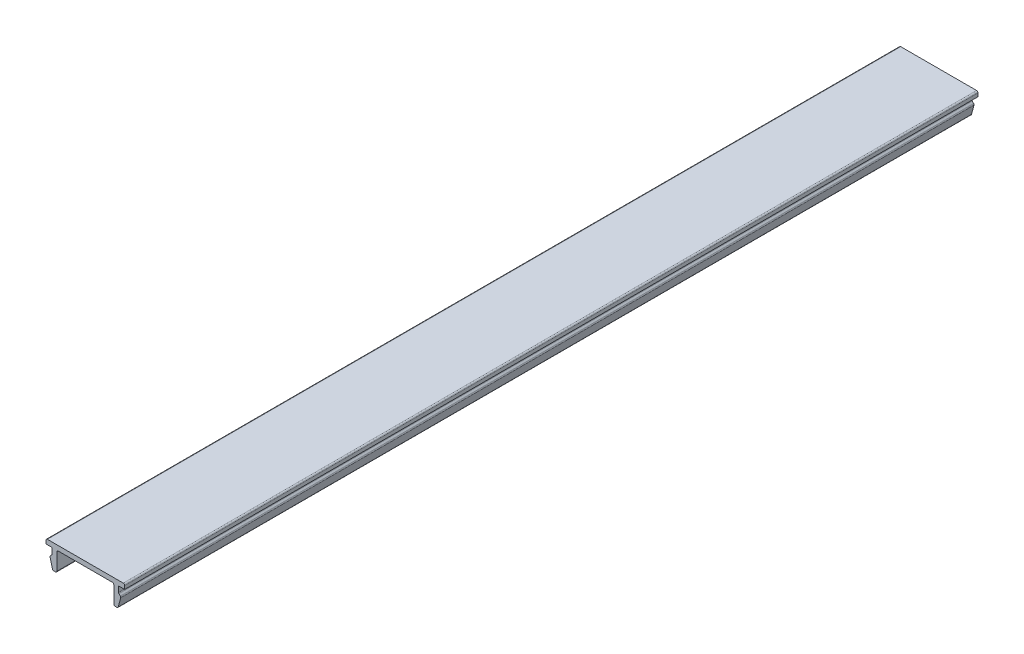
ISO-10303-21;
HEADER;
FILE_DESCRIPTION(('STEP AP214'),'2;1');
FILE_NAME('part.step','',(''),(''),'','','');
FILE_SCHEMA(('AUTOMOTIVE_DESIGN { 1 0 10303 214 1 1 1 1 }'));
ENDSEC;
DATA;
#1=APPLICATION_CONTEXT('core data for automotive mechanical design processes');
#2=APPLICATION_PROTOCOL_DEFINITION('international standard','automotive_design',2000,#1);
#3=PRODUCT_CONTEXT('',#1,'mechanical');
#4=PRODUCT('Part','Part','',(#3));
#5=PRODUCT_RELATED_PRODUCT_CATEGORY('part','',(#4));
#6=PRODUCT_DEFINITION_FORMATION('','',#4);
#7=PRODUCT_DEFINITION_CONTEXT('part definition',#1,'design');
#8=PRODUCT_DEFINITION('design','',#6,#7);
#9=PRODUCT_DEFINITION_SHAPE('','',#8);
#10=(LENGTH_UNIT() NAMED_UNIT(*) SI_UNIT(.MILLI.,.METRE.));
#11=(NAMED_UNIT(*) PLANE_ANGLE_UNIT() SI_UNIT($,.RADIAN.));
#12=(NAMED_UNIT(*) SI_UNIT($,.STERADIAN.) SOLID_ANGLE_UNIT());
#13=UNCERTAINTY_MEASURE_WITH_UNIT(LENGTH_MEASURE(1.E-05),#10,'distance_accuracy_value','');
#14=(GEOMETRIC_REPRESENTATION_CONTEXT(3) GLOBAL_UNCERTAINTY_ASSIGNED_CONTEXT((#13)) GLOBAL_UNIT_ASSIGNED_CONTEXT((#10,
#11,#12)) REPRESENTATION_CONTEXT('',''));
#15=CARTESIAN_POINT('',(0.,0.,0.));
#16=DIRECTION('',(0.,0.,1.));
#17=DIRECTION('',(1.,0.,0.));
#18=AXIS2_PLACEMENT_3D('',#15,#16,#17);
#19=CARTESIAN_POINT('',(-8.3,1.,180.));
#20=DIRECTION('',(1.,0.,0.));
#21=DIRECTION('',(0.,0.,-1.));
#22=AXIS2_PLACEMENT_3D('',#19,#20,#21);
#23=PLANE('',#22);
#24=DIRECTION('',(0.,-1.,0.));
#25=VECTOR('',#24,1.);
#26=CARTESIAN_POINT('',(-8.3,1.,180.));
#27=LINE('',#26,#25);
#28=CARTESIAN_POINT('',(-8.3,0.7,180.));
#29=VERTEX_POINT('',#28);
#30=CARTESIAN_POINT('',(-8.3,0.,180.));
#31=VERTEX_POINT('',#30);
#32=EDGE_CURVE('E224',#29,#31,#27,.T.);
#33=ORIENTED_EDGE('',*,*,#32,.F.);
#34=DIRECTION('',(0.,0.,-1.));
#35=VECTOR('',#34,1.);
#36=CARTESIAN_POINT('',(-8.3,0.7,180.));
#37=LINE('',#36,#35);
#38=CARTESIAN_POINT('',(-8.3,0.7,0.));
#39=VERTEX_POINT('',#38);
#40=EDGE_CURVE('E387',#29,#39,#37,.T.);
#41=ORIENTED_EDGE('',*,*,#40,.T.);
#42=DIRECTION('',(0.,-1.,0.));
#43=VECTOR('',#42,1.);
#44=CARTESIAN_POINT('',(-8.3,1.,0.));
#45=LINE('',#44,#43);
#46=CARTESIAN_POINT('',(-8.3,0.,0.));
#47=VERTEX_POINT('',#46);
#48=EDGE_CURVE('E252',#39,#47,#45,.T.);
#49=ORIENTED_EDGE('',*,*,#48,.T.);
#50=DIRECTION('',(0.,0.,-1.));
#51=VECTOR('',#50,1.);
#52=CARTESIAN_POINT('',(-8.3,0.,180.));
#53=LINE('',#52,#51);
#54=EDGE_CURVE('E244',#31,#47,#53,.T.);
#55=ORIENTED_EDGE('',*,*,#54,.F.);
#56=EDGE_LOOP('',(#33,#41,#49,#55));
#57=FACE_BOUND('',#56,.T.);
#58=ADVANCED_FACE('F39',(#57),#23,.F.);
#59=CARTESIAN_POINT('',(-8.3,0.,180.));
#60=DIRECTION('',(0.,1.,0.));
#61=DIRECTION('',(0.,0.,1.));
#62=AXIS2_PLACEMENT_3D('',#59,#60,#61);
#63=PLANE('',#62);
#64=DIRECTION('',(1.,0.,0.));
#65=VECTOR('',#64,1.);
#66=CARTESIAN_POINT('',(-8.3,0.,0.));
#67=LINE('',#66,#65);
#68=CARTESIAN_POINT('',(-7.,0.,0.));
#69=VERTEX_POINT('',#68);
#70=EDGE_CURVE('E422',#47,#69,#67,.T.);
#71=ORIENTED_EDGE('',*,*,#70,.T.);
#72=DIRECTION('',(0.,0.,-1.));
#73=VECTOR('',#72,1.);
#74=CARTESIAN_POINT('',(-7.,0.,180.));
#75=LINE('',#74,#73);
#76=CARTESIAN_POINT('',(-7.,0.,180.));
#77=VERTEX_POINT('',#76);
#78=EDGE_CURVE('E246',#77,#69,#75,.T.);
#79=ORIENTED_EDGE('',*,*,#78,.F.);
#80=DIRECTION('',(1.,0.,0.));
#81=VECTOR('',#80,1.);
#82=CARTESIAN_POINT('',(-8.3,0.,180.));
#83=LINE('',#82,#81);
#84=EDGE_CURVE('E229',#31,#77,#83,.T.);
#85=ORIENTED_EDGE('',*,*,#84,.F.);
#86=ORIENTED_EDGE('',*,*,#54,.T.);
#87=EDGE_LOOP('',(#71,#79,#85,#86));
#88=FACE_BOUND('',#87,.T.);
#89=ADVANCED_FACE('F243',(#88),#63,.F.);
#90=CARTESIAN_POINT('',(-7.,0.,180.));
#91=DIRECTION('',(1.,0.,0.));
#92=DIRECTION('',(0.,0.,-1.));
#93=AXIS2_PLACEMENT_3D('',#90,#91,#92);
#94=PLANE('',#93);
#95=DIRECTION('',(0.,-1.,0.));
#96=VECTOR('',#95,1.);
#97=CARTESIAN_POINT('',(-7.,0.,0.));
#98=LINE('',#97,#96);
#99=CARTESIAN_POINT('',(-7.,-1.17573593128807,0.));
#100=VERTEX_POINT('',#99);
#101=EDGE_CURVE('E413',#69,#100,#98,.T.);
#102=ORIENTED_EDGE('',*,*,#101,.T.);
#103=DIRECTION('',(0.,0.,-1.));
#104=VECTOR('',#103,1.);
#105=CARTESIAN_POINT('',(-7.,-1.17573593128807,180.));
#106=LINE('',#105,#104);
#107=CARTESIAN_POINT('',(-7.,-1.17573593128807,180.));
#108=VERTEX_POINT('',#107);
#109=EDGE_CURVE('E384',#100,#108,#106,.F.);
#110=ORIENTED_EDGE('',*,*,#109,.T.);
#111=DIRECTION('',(0.,-1.,0.));
#112=VECTOR('',#111,1.);
#113=CARTESIAN_POINT('',(-7.,0.,180.));
#114=LINE('',#113,#112);
#115=EDGE_CURVE('E249',#77,#108,#114,.T.);
#116=ORIENTED_EDGE('',*,*,#115,.F.);
#117=ORIENTED_EDGE('',*,*,#78,.T.);
#118=EDGE_LOOP('',(#102,#110,#116,#117));
#119=FACE_BOUND('',#118,.T.);
#120=ADVANCED_FACE('F420',(#119),#94,.F.);
#121=CARTESIAN_POINT('',(-7.,-1.3,180.));
#122=DIRECTION('',(0.707106781186547,-0.707106781186548,0.));
#123=DIRECTION('',(0.707106781186548,0.707106781186547,0.));
#124=AXIS2_PLACEMENT_3D('',#121,#122,#123);
#125=PLANE('',#124);
#126=DIRECTION('',(-0.707106781186548,-0.707106781186547,0.));
#127=VECTOR('',#126,1.);
#128=CARTESIAN_POINT('',(-7.,-1.3,0.));
#129=LINE('',#128,#127);
#130=CARTESIAN_POINT('',(-7.08786796564404,-1.38786796564404,0.));
#131=VERTEX_POINT('',#130);
#132=CARTESIAN_POINT('',(-7.37752551286084,-1.67752551286084,0.));
#133=VERTEX_POINT('',#132);
#134=EDGE_CURVE('E415',#131,#133,#129,.T.);
#135=ORIENTED_EDGE('',*,*,#134,.T.);
#136=DIRECTION('',(0.,0.,-1.));
#137=VECTOR('',#136,1.);
#138=CARTESIAN_POINT('',(-7.37752551286084,-1.67752551286084,180.));
#139=LINE('',#138,#137);
#140=CARTESIAN_POINT('',(-7.37752551286084,-1.67752551286084,180.));
#141=VERTEX_POINT('',#140);
#142=EDGE_CURVE('E381',#133,#141,#139,.F.);
#143=ORIENTED_EDGE('',*,*,#142,.T.);
#144=DIRECTION('',(-0.707106781186548,-0.707106781186547,0.));
#145=VECTOR('',#144,1.);
#146=CARTESIAN_POINT('',(-7.,-1.3,180.));
#147=LINE('',#146,#145);
#148=CARTESIAN_POINT('',(-7.08786796564404,-1.38786796564404,180.));
#149=VERTEX_POINT('',#148);
#150=EDGE_CURVE('E428',#149,#141,#147,.T.);
#151=ORIENTED_EDGE('',*,*,#150,.F.);
#152=DIRECTION('',(0.,0.,-1.));
#153=VECTOR('',#152,1.);
#154=CARTESIAN_POINT('',(-7.08786796564404,-1.38786796564404,0.));
#155=LINE('',#154,#153);
#156=EDGE_CURVE('E377',#149,#131,#155,.T.);
#157=ORIENTED_EDGE('',*,*,#156,.T.);
#158=EDGE_LOOP('',(#135,#143,#151,#157));
#159=FACE_BOUND('',#158,.T.);
#160=ADVANCED_FACE('F431',(#159),#125,.F.);
#161=CARTESIAN_POINT('',(-7.5,-1.8,180.));
#162=DIRECTION('',(0.965925826289068,0.258819045102522,0.));
#163=DIRECTION('',(-0.258819045102522,0.965925826289068,0.));
#164=AXIS2_PLACEMENT_3D('',#161,#162,#163);
#165=PLANE('',#164);
#166=DIRECTION('',(0.258819045102522,-0.965925826289068,0.));
#167=VECTOR('',#166,1.);
#168=CARTESIAN_POINT('',(-7.5,-1.8,0.));
#169=LINE('',#168,#167);
#170=CARTESIAN_POINT('',(-7.4551712263916,-1.96730326074756,0.));
#171=VERTEX_POINT('',#170);
#172=CARTESIAN_POINT('',(-6.94329650890145,-3.87764571353076,0.));
#173=VERTEX_POINT('',#172);
#174=EDGE_CURVE('E488',#171,#173,#169,.T.);
#175=ORIENTED_EDGE('',*,*,#174,.T.);
#176=DIRECTION('',(0.,0.,-1.));
#177=VECTOR('',#176,1.);
#178=CARTESIAN_POINT('',(-6.94329650890145,-3.87764571353076,180.));
#179=LINE('',#178,#177);
#180=CARTESIAN_POINT('',(-6.94329650890145,-3.87764571353076,180.));
#181=VERTEX_POINT('',#180);
#182=EDGE_CURVE('E374',#173,#181,#179,.F.);
#183=ORIENTED_EDGE('',*,*,#182,.T.);
#184=DIRECTION('',(0.258819045102522,-0.965925826289068,0.));
#185=VECTOR('',#184,1.);
#186=CARTESIAN_POINT('',(-7.5,-1.8,180.));
#187=LINE('',#186,#185);
#188=CARTESIAN_POINT('',(-7.4551712263916,-1.96730326074756,180.));
#189=VERTEX_POINT('',#188);
#190=EDGE_CURVE('E434',#189,#181,#187,.T.);
#191=ORIENTED_EDGE('',*,*,#190,.F.);
#192=DIRECTION('',(0.,0.,-1.));
#193=VECTOR('',#192,1.);
#194=CARTESIAN_POINT('',(-7.4551712263916,-1.96730326074756,180.));
#195=LINE('',#194,#193);
#196=EDGE_CURVE('E370',#189,#171,#195,.T.);
#197=ORIENTED_EDGE('',*,*,#196,.T.);
#198=EDGE_LOOP('',(#175,#183,#191,#197));
#199=FACE_BOUND('',#198,.T.);
#200=ADVANCED_FACE('F613',(#199),#165,.F.);
#201=CARTESIAN_POINT('',(-6.,-4.1,180.));
#202=DIRECTION('',(0.,1.,0.));
#203=DIRECTION('',(0.,0.,1.));
#204=AXIS2_PLACEMENT_3D('',#201,#202,#203);
#205=PLANE('',#204);
#206=DIRECTION('',(1.,0.,0.));
#207=VECTOR('',#206,1.);
#208=CARTESIAN_POINT('',(-6.,-4.1,0.));
#209=LINE('',#208,#207);
#210=CARTESIAN_POINT('',(-6.65351876101473,-4.1,0.));
#211=VERTEX_POINT('',#210);
#212=CARTESIAN_POINT('',(-6.3,-4.1,0.));
#213=VERTEX_POINT('',#212);
#214=EDGE_CURVE('E492',#211,#213,#209,.T.);
#215=ORIENTED_EDGE('',*,*,#214,.T.);
#216=DIRECTION('',(0.,0.,-1.));
#217=VECTOR('',#216,1.);
#218=CARTESIAN_POINT('',(-6.3,-4.1,180.));
#219=LINE('',#218,#217);
#220=CARTESIAN_POINT('',(-6.3,-4.1,180.));
#221=VERTEX_POINT('',#220);
#222=EDGE_CURVE('E367',#213,#221,#219,.F.);
#223=ORIENTED_EDGE('',*,*,#222,.T.);
#224=DIRECTION('',(1.,0.,0.));
#225=VECTOR('',#224,1.);
#226=CARTESIAN_POINT('',(-6.,-4.1,180.));
#227=LINE('',#226,#225);
#228=CARTESIAN_POINT('',(-6.65351876101473,-4.1,180.));
#229=VERTEX_POINT('',#228);
#230=EDGE_CURVE('E439',#229,#221,#227,.T.);
#231=ORIENTED_EDGE('',*,*,#230,.F.);
#232=DIRECTION('',(0.,0.,-1.));
#233=VECTOR('',#232,1.);
#234=CARTESIAN_POINT('',(-6.65351876101473,-4.1,180.));
#235=LINE('',#234,#233);
#236=EDGE_CURVE('E363',#229,#211,#235,.T.);
#237=ORIENTED_EDGE('',*,*,#236,.T.);
#238=EDGE_LOOP('',(#215,#223,#231,#237));
#239=FACE_BOUND('',#238,.T.);
#240=ADVANCED_FACE('F620',(#239),#205,.F.);
#241=CARTESIAN_POINT('',(-6.,0.,180.));
#242=DIRECTION('',(-1.,0.,0.));
#243=DIRECTION('',(0.,-1.,0.));
#244=AXIS2_PLACEMENT_3D('',#241,#242,#243);
#245=PLANE('',#244);
#246=DIRECTION('',(0.,1.,0.));
#247=VECTOR('',#246,1.);
#248=CARTESIAN_POINT('',(-6.,0.,0.));
#249=LINE('',#248,#247);
#250=CARTESIAN_POINT('',(-6.,-3.8,0.));
#251=VERTEX_POINT('',#250);
#252=CARTESIAN_POINT('',(-6.,-0.3,0.));
#253=VERTEX_POINT('',#252);
#254=EDGE_CURVE('E496',#251,#253,#249,.T.);
#255=ORIENTED_EDGE('',*,*,#254,.T.);
#256=DIRECTION('',(0.,0.,-1.));
#257=VECTOR('',#256,1.);
#258=CARTESIAN_POINT('',(-6.,-0.3,180.));
#259=LINE('',#258,#257);
#260=CARTESIAN_POINT('',(-6.,-0.3,180.));
#261=VERTEX_POINT('',#260);
#262=EDGE_CURVE('E360',#253,#261,#259,.F.);
#263=ORIENTED_EDGE('',*,*,#262,.T.);
#264=DIRECTION('',(0.,1.,0.));
#265=VECTOR('',#264,1.);
#266=CARTESIAN_POINT('',(-6.,0.,180.));
#267=LINE('',#266,#265);
#268=CARTESIAN_POINT('',(-6.,-3.8,180.));
#269=VERTEX_POINT('',#268);
#270=EDGE_CURVE('E446',#269,#261,#267,.T.);
#271=ORIENTED_EDGE('',*,*,#270,.F.);
#272=DIRECTION('',(0.,0.,-1.));
#273=VECTOR('',#272,1.);
#274=CARTESIAN_POINT('',(-6.,-3.8,180.));
#275=LINE('',#274,#273);
#276=EDGE_CURVE('E356',#269,#251,#275,.T.);
#277=ORIENTED_EDGE('',*,*,#276,.T.);
#278=EDGE_LOOP('',(#255,#263,#271,#277));
#279=FACE_BOUND('',#278,.T.);
#280=ADVANCED_FACE('F627',(#279),#245,.F.);
#281=CARTESIAN_POINT('',(-6.,0.,180.));
#282=DIRECTION('',(0.,1.,0.));
#283=DIRECTION('',(0.,0.,1.));
#284=AXIS2_PLACEMENT_3D('',#281,#282,#283);
#285=PLANE('',#284);
#286=DIRECTION('',(1.,0.,0.));
#287=VECTOR('',#286,1.);
#288=CARTESIAN_POINT('',(-6.,0.,0.));
#289=LINE('',#288,#287);
#290=CARTESIAN_POINT('',(-5.7,0.,0.));
#291=VERTEX_POINT('',#290);
#292=CARTESIAN_POINT('',(5.69999999999999,0.,0.));
#293=VERTEX_POINT('',#292);
#294=EDGE_CURVE('E500',#291,#293,#289,.T.);
#295=ORIENTED_EDGE('',*,*,#294,.T.);
#296=DIRECTION('',(0.,0.,-1.));
#297=VECTOR('',#296,1.);
#298=CARTESIAN_POINT('',(5.69999999999999,0.,180.));
#299=LINE('',#298,#297);
#300=CARTESIAN_POINT('',(5.69999999999999,0.,180.));
#301=VERTEX_POINT('',#300);
#302=EDGE_CURVE('E353',#293,#301,#299,.F.);
#303=ORIENTED_EDGE('',*,*,#302,.T.);
#304=DIRECTION('',(1.,0.,0.));
#305=VECTOR('',#304,1.);
#306=CARTESIAN_POINT('',(-6.,0.,180.));
#307=LINE('',#306,#305);
#308=CARTESIAN_POINT('',(-5.7,0.,180.));
#309=VERTEX_POINT('',#308);
#310=EDGE_CURVE('E450',#309,#301,#307,.T.);
#311=ORIENTED_EDGE('',*,*,#310,.F.);
#312=DIRECTION('',(0.,0.,-1.));
#313=VECTOR('',#312,1.);
#314=CARTESIAN_POINT('',(-5.7,0.,0.));
#315=LINE('',#314,#313);
#316=EDGE_CURVE('E349',#309,#291,#315,.T.);
#317=ORIENTED_EDGE('',*,*,#316,.T.);
#318=EDGE_LOOP('',(#295,#303,#311,#317));
#319=FACE_BOUND('',#318,.T.);
#320=ADVANCED_FACE('F634',(#319),#285,.F.);
#321=CARTESIAN_POINT('',(5.99999999999999,0.,180.));
#322=DIRECTION('',(1.,0.,0.));
#323=DIRECTION('',(0.,1.,0.));
#324=AXIS2_PLACEMENT_3D('',#321,#322,#323);
#325=PLANE('',#324);
#326=DIRECTION('',(0.,-1.,0.));
#327=VECTOR('',#326,1.);
#328=CARTESIAN_POINT('',(5.99999999999999,0.,0.));
#329=LINE('',#328,#327);
#330=CARTESIAN_POINT('',(5.99999999999999,-0.3,0.));
#331=VERTEX_POINT('',#330);
#332=CARTESIAN_POINT('',(5.99999999999999,-3.8,0.));
#333=VERTEX_POINT('',#332);
#334=EDGE_CURVE('E504',#331,#333,#329,.T.);
#335=ORIENTED_EDGE('',*,*,#334,.T.);
#336=DIRECTION('',(0.,0.,-1.));
#337=VECTOR('',#336,1.);
#338=CARTESIAN_POINT('',(5.99999999999999,-3.8,180.));
#339=LINE('',#338,#337);
#340=CARTESIAN_POINT('',(5.99999999999999,-3.8,180.));
#341=VERTEX_POINT('',#340);
#342=EDGE_CURVE('E346',#333,#341,#339,.F.);
#343=ORIENTED_EDGE('',*,*,#342,.T.);
#344=DIRECTION('',(0.,-1.,0.));
#345=VECTOR('',#344,1.);
#346=CARTESIAN_POINT('',(5.99999999999999,0.,180.));
#347=LINE('',#346,#345);
#348=CARTESIAN_POINT('',(5.99999999999999,-0.3,180.));
#349=VERTEX_POINT('',#348);
#350=EDGE_CURVE('E454',#349,#341,#347,.T.);
#351=ORIENTED_EDGE('',*,*,#350,.F.);
#352=DIRECTION('',(0.,0.,-1.));
#353=VECTOR('',#352,1.);
#354=CARTESIAN_POINT('',(5.99999999999999,-0.3,0.));
#355=LINE('',#354,#353);
#356=EDGE_CURVE('E342',#349,#331,#355,.T.);
#357=ORIENTED_EDGE('',*,*,#356,.T.);
#358=EDGE_LOOP('',(#335,#343,#351,#357));
#359=FACE_BOUND('',#358,.T.);
#360=ADVANCED_FACE('F641',(#359),#325,.F.);
#361=CARTESIAN_POINT('',(5.99999999999999,-4.1,180.));
#362=DIRECTION('',(0.,1.,0.));
#363=DIRECTION('',(0.,0.,1.));
#364=AXIS2_PLACEMENT_3D('',#361,#362,#363);
#365=PLANE('',#364);
#366=DIRECTION('',(1.,0.,0.));
#367=VECTOR('',#366,1.);
#368=CARTESIAN_POINT('',(5.99999999999999,-4.1,0.));
#369=LINE('',#368,#367);
#370=CARTESIAN_POINT('',(6.29999999999999,-4.1,0.));
#371=VERTEX_POINT('',#370);
#372=CARTESIAN_POINT('',(6.65351876101472,-4.1,0.));
#373=VERTEX_POINT('',#372);
#374=EDGE_CURVE('E508',#371,#373,#369,.T.);
#375=ORIENTED_EDGE('',*,*,#374,.T.);
#376=DIRECTION('',(0.,0.,-1.));
#377=VECTOR('',#376,1.);
#378=CARTESIAN_POINT('',(6.65351876101472,-4.1,180.));
#379=LINE('',#378,#377);
#380=CARTESIAN_POINT('',(6.65351876101472,-4.1,180.));
#381=VERTEX_POINT('',#380);
#382=EDGE_CURVE('E339',#373,#381,#379,.F.);
#383=ORIENTED_EDGE('',*,*,#382,.T.);
#384=DIRECTION('',(1.,0.,0.));
#385=VECTOR('',#384,1.);
#386=CARTESIAN_POINT('',(5.99999999999999,-4.1,180.));
#387=LINE('',#386,#385);
#388=CARTESIAN_POINT('',(6.29999999999999,-4.1,180.));
#389=VERTEX_POINT('',#388);
#390=EDGE_CURVE('E458',#389,#381,#387,.T.);
#391=ORIENTED_EDGE('',*,*,#390,.F.);
#392=DIRECTION('',(0.,0.,-1.));
#393=VECTOR('',#392,1.);
#394=CARTESIAN_POINT('',(6.29999999999999,-4.1,180.));
#395=LINE('',#394,#393);
#396=EDGE_CURVE('E335',#389,#371,#395,.T.);
#397=ORIENTED_EDGE('',*,*,#396,.T.);
#398=EDGE_LOOP('',(#375,#383,#391,#397));
#399=FACE_BOUND('',#398,.T.);
#400=ADVANCED_FACE('F648',(#399),#365,.F.);
#401=CARTESIAN_POINT('',(7.49999999999999,-1.8,180.));
#402=DIRECTION('',(-0.965925826289068,0.258819045102522,0.));
#403=DIRECTION('',(-0.258819045102522,-0.965925826289068,0.));
#404=AXIS2_PLACEMENT_3D('',#401,#402,#403);
#405=PLANE('',#404);
#406=DIRECTION('',(0.258819045102522,0.965925826289068,0.));
#407=VECTOR('',#406,1.);
#408=CARTESIAN_POINT('',(7.49999999999999,-1.8,0.));
#409=LINE('',#408,#407);
#410=CARTESIAN_POINT('',(6.94329650890144,-3.87764571353075,0.));
#411=VERTEX_POINT('',#410);
#412=CARTESIAN_POINT('',(7.45517122639159,-1.96730326074756,0.));
#413=VERTEX_POINT('',#412);
#414=EDGE_CURVE('E512',#411,#413,#409,.T.);
#415=ORIENTED_EDGE('',*,*,#414,.T.);
#416=DIRECTION('',(0.,0.,-1.));
#417=VECTOR('',#416,1.);
#418=CARTESIAN_POINT('',(7.45517122639159,-1.96730326074756,180.));
#419=LINE('',#418,#417);
#420=CARTESIAN_POINT('',(7.45517122639159,-1.96730326074756,180.));
#421=VERTEX_POINT('',#420);
#422=EDGE_CURVE('E332',#413,#421,#419,.F.);
#423=ORIENTED_EDGE('',*,*,#422,.T.);
#424=DIRECTION('',(0.258819045102522,0.965925826289068,0.));
#425=VECTOR('',#424,1.);
#426=CARTESIAN_POINT('',(7.49999999999999,-1.8,180.));
#427=LINE('',#426,#425);
#428=CARTESIAN_POINT('',(6.94329650890144,-3.87764571353075,180.));
#429=VERTEX_POINT('',#428);
#430=EDGE_CURVE('E462',#429,#421,#427,.T.);
#431=ORIENTED_EDGE('',*,*,#430,.F.);
#432=DIRECTION('',(0.,0.,-1.));
#433=VECTOR('',#432,1.);
#434=CARTESIAN_POINT('',(6.94329650890144,-3.87764571353075,180.));
#435=LINE('',#434,#433);
#436=EDGE_CURVE('E328',#429,#411,#435,.T.);
#437=ORIENTED_EDGE('',*,*,#436,.T.);
#438=EDGE_LOOP('',(#415,#423,#431,#437));
#439=FACE_BOUND('',#438,.T.);
#440=ADVANCED_FACE('F655',(#439),#405,.F.);
#441=CARTESIAN_POINT('',(6.99999999999999,-1.3,180.));
#442=DIRECTION('',(-0.707106781186547,-0.707106781186548,0.));
#443=DIRECTION('',(0.707106781186548,-0.707106781186547,0.));
#444=AXIS2_PLACEMENT_3D('',#441,#442,#443);
#445=PLANE('',#444);
#446=DIRECTION('',(-0.707106781186548,0.707106781186547,0.));
#447=VECTOR('',#446,1.);
#448=CARTESIAN_POINT('',(6.99999999999999,-1.3,0.));
#449=LINE('',#448,#447);
#450=CARTESIAN_POINT('',(7.37752551286083,-1.67752551286084,0.));
#451=VERTEX_POINT('',#450);
#452=CARTESIAN_POINT('',(7.08786796564403,-1.38786796564403,0.));
#453=VERTEX_POINT('',#452);
#454=EDGE_CURVE('E516',#451,#453,#449,.T.);
#455=ORIENTED_EDGE('',*,*,#454,.T.);
#456=DIRECTION('',(0.,0.,-1.));
#457=VECTOR('',#456,1.);
#458=CARTESIAN_POINT('',(7.08786796564403,-1.38786796564403,180.));
#459=LINE('',#458,#457);
#460=CARTESIAN_POINT('',(7.08786796564403,-1.38786796564403,180.));
#461=VERTEX_POINT('',#460);
#462=EDGE_CURVE('E63',#453,#461,#459,.F.);
#463=ORIENTED_EDGE('',*,*,#462,.T.);
#464=DIRECTION('',(-0.707106781186548,0.707106781186547,0.));
#465=VECTOR('',#464,1.);
#466=CARTESIAN_POINT('',(6.99999999999999,-1.3,180.));
#467=LINE('',#466,#465);
#468=CARTESIAN_POINT('',(7.37752551286083,-1.67752551286084,180.));
#469=VERTEX_POINT('',#468);
#470=EDGE_CURVE('E466',#469,#461,#467,.T.);
#471=ORIENTED_EDGE('',*,*,#470,.F.);
#472=DIRECTION('',(0.,0.,-1.));
#473=VECTOR('',#472,1.);
#474=CARTESIAN_POINT('',(7.37752551286083,-1.67752551286084,180.));
#475=LINE('',#474,#473);
#476=EDGE_CURVE('E322',#469,#451,#475,.T.);
#477=ORIENTED_EDGE('',*,*,#476,.T.);
#478=EDGE_LOOP('',(#455,#463,#471,#477));
#479=FACE_BOUND('',#478,.T.);
#480=ADVANCED_FACE('F659',(#479),#445,.F.);
#481=CARTESIAN_POINT('',(6.99999999999999,0.,180.));
#482=DIRECTION('',(-1.,0.,0.));
#483=DIRECTION('',(0.,0.,1.));
#484=AXIS2_PLACEMENT_3D('',#481,#482,#483);
#485=PLANE('',#484);
#486=DIRECTION('',(0.,1.,0.));
#487=VECTOR('',#486,1.);
#488=CARTESIAN_POINT('',(6.99999999999999,0.,180.));
#489=LINE('',#488,#487);
#490=CARTESIAN_POINT('',(6.99999999999999,-1.17573593128807,180.));
#491=VERTEX_POINT('',#490);
#492=CARTESIAN_POINT('',(6.99999999999999,0.,180.));
#493=VERTEX_POINT('',#492);
#494=EDGE_CURVE('E469',#491,#493,#489,.T.);
#495=ORIENTED_EDGE('',*,*,#494,.F.);
#496=DIRECTION('',(0.,0.,-1.));
#497=VECTOR('',#496,1.);
#498=CARTESIAN_POINT('',(6.99999999999999,-1.17573593128807,0.));
#499=LINE('',#498,#497);
#500=CARTESIAN_POINT('',(6.99999999999999,-1.17573593128807,0.));
#501=VERTEX_POINT('',#500);
#502=EDGE_CURVE('E318',#491,#501,#499,.T.);
#503=ORIENTED_EDGE('',*,*,#502,.T.);
#504=DIRECTION('',(0.,1.,0.));
#505=VECTOR('',#504,1.);
#506=CARTESIAN_POINT('',(6.99999999999999,0.,0.));
#507=LINE('',#506,#505);
#508=CARTESIAN_POINT('',(6.99999999999999,0.,0.));
#509=VERTEX_POINT('',#508);
#510=EDGE_CURVE('E519',#501,#509,#507,.T.);
#511=ORIENTED_EDGE('',*,*,#510,.T.);
#512=DIRECTION('',(0.,0.,-1.));
#513=VECTOR('',#512,1.);
#514=CARTESIAN_POINT('',(6.99999999999999,0.,180.));
#515=LINE('',#514,#513);
#516=EDGE_CURVE('E261',#493,#509,#515,.T.);
#517=ORIENTED_EDGE('',*,*,#516,.F.);
#518=EDGE_LOOP('',(#495,#503,#511,#517));
#519=FACE_BOUND('',#518,.T.);
#520=ADVANCED_FACE('F662',(#519),#485,.F.);
#521=CARTESIAN_POINT('',(6.99999999999999,0.,180.));
#522=DIRECTION('',(0.,1.,0.));
#523=DIRECTION('',(0.,0.,1.));
#524=AXIS2_PLACEMENT_3D('',#521,#522,#523);
#525=PLANE('',#524);
#526=DIRECTION('',(1.,0.,0.));
#527=VECTOR('',#526,1.);
#528=CARTESIAN_POINT('',(6.99999999999999,0.,0.));
#529=LINE('',#528,#527);
#530=CARTESIAN_POINT('',(8.3,0.,0.));
#531=VERTEX_POINT('',#530);
#532=EDGE_CURVE('E522',#509,#531,#529,.T.);
#533=ORIENTED_EDGE('',*,*,#532,.T.);
#534=DIRECTION('',(0.,0.,-1.));
#535=VECTOR('',#534,1.);
#536=CARTESIAN_POINT('',(8.3,0.,180.));
#537=LINE('',#536,#535);
#538=CARTESIAN_POINT('',(8.3,0.,180.));
#539=VERTEX_POINT('',#538);
#540=EDGE_CURVE('E481',#539,#531,#537,.T.);
#541=ORIENTED_EDGE('',*,*,#540,.F.);
#542=DIRECTION('',(1.,0.,0.));
#543=VECTOR('',#542,1.);
#544=CARTESIAN_POINT('',(6.99999999999999,0.,180.));
#545=LINE('',#544,#543);
#546=EDGE_CURVE('E472',#493,#539,#545,.T.);
#547=ORIENTED_EDGE('',*,*,#546,.F.);
#548=ORIENTED_EDGE('',*,*,#516,.T.);
#549=EDGE_LOOP('',(#533,#541,#547,#548));
#550=FACE_BOUND('',#549,.T.);
#551=ADVANCED_FACE('F540',(#550),#525,.F.);
#552=CARTESIAN_POINT('',(8.3,1.,180.));
#553=DIRECTION('',(-1.,0.,0.));
#554=DIRECTION('',(0.,0.,1.));
#555=AXIS2_PLACEMENT_3D('',#552,#553,#554);
#556=PLANE('',#555);
#557=DIRECTION('',(0.,1.,0.));
#558=VECTOR('',#557,1.);
#559=CARTESIAN_POINT('',(8.3,1.,0.));
#560=LINE('',#559,#558);
#561=CARTESIAN_POINT('',(8.3,0.700000000000004,0.));
#562=VERTEX_POINT('',#561);
#563=EDGE_CURVE('E525',#531,#562,#560,.T.);
#564=ORIENTED_EDGE('',*,*,#563,.T.);
#565=DIRECTION('',(0.,0.,-1.));
#566=VECTOR('',#565,1.);
#567=CARTESIAN_POINT('',(8.3,0.700000000000004,180.));
#568=LINE('',#567,#566);
#569=CARTESIAN_POINT('',(8.3,0.700000000000004,180.));
#570=VERTEX_POINT('',#569);
#571=EDGE_CURVE('E292',#562,#570,#568,.F.);
#572=ORIENTED_EDGE('',*,*,#571,.T.);
#573=DIRECTION('',(0.,1.,0.));
#574=VECTOR('',#573,1.);
#575=CARTESIAN_POINT('',(8.3,1.,180.));
#576=LINE('',#575,#574);
#577=EDGE_CURVE('E475',#539,#570,#576,.T.);
#578=ORIENTED_EDGE('',*,*,#577,.F.);
#579=ORIENTED_EDGE('',*,*,#540,.T.);
#580=EDGE_LOOP('',(#564,#572,#578,#579));
#581=FACE_BOUND('',#580,.T.);
#582=ADVANCED_FACE('F547',(#581),#556,.F.);
#583=CARTESIAN_POINT('',(-8.3,1.,180.));
#584=DIRECTION('',(0.,-1.,0.));
#585=DIRECTION('',(1.,0.,0.));
#586=AXIS2_PLACEMENT_3D('',#583,#584,#585);
#587=PLANE('',#586);
#588=DIRECTION('',(-1.,0.,0.));
#589=VECTOR('',#588,1.);
#590=CARTESIAN_POINT('',(-8.3,1.,180.));
#591=LINE('',#590,#589);
#592=CARTESIAN_POINT('',(7.99999999999999,1.,180.));
#593=VERTEX_POINT('',#592);
#594=CARTESIAN_POINT('',(-8.,1.,180.));
#595=VERTEX_POINT('',#594);
#596=EDGE_CURVE('E478',#593,#595,#591,.T.);
#597=ORIENTED_EDGE('',*,*,#596,.F.);
#598=DIRECTION('',(0.,0.,-1.));
#599=VECTOR('',#598,1.);
#600=CARTESIAN_POINT('',(8.,1.,180.));
#601=LINE('',#600,#599);
#602=CARTESIAN_POINT('',(7.99999999999999,1.,0.));
#603=VERTEX_POINT('',#602);
#604=EDGE_CURVE('E259',#593,#603,#601,.T.);
#605=ORIENTED_EDGE('',*,*,#604,.T.);
#606=DIRECTION('',(-1.,0.,0.));
#607=VECTOR('',#606,1.);
#608=CARTESIAN_POINT('',(-8.3,1.,0.));
#609=LINE('',#608,#607);
#610=CARTESIAN_POINT('',(-8.,1.,0.));
#611=VERTEX_POINT('',#610);
#612=EDGE_CURVE('E239',#603,#611,#609,.T.);
#613=ORIENTED_EDGE('',*,*,#612,.T.);
#614=DIRECTION('',(0.,0.,-1.));
#615=VECTOR('',#614,1.);
#616=CARTESIAN_POINT('',(-8.,1.,180.));
#617=LINE('',#616,#615);
#618=EDGE_CURVE('E255',#611,#595,#617,.F.);
#619=ORIENTED_EDGE('',*,*,#618,.T.);
#620=EDGE_LOOP('',(#597,#605,#613,#619));
#621=FACE_BOUND('',#620,.T.);
#622=ADVANCED_FACE('F555',(#621),#587,.F.);
#623=CARTESIAN_POINT('',(0.,0.,180.));
#624=DIRECTION('',(0.,0.,1.));
#625=DIRECTION('',(1.,0.,0.));
#626=AXIS2_PLACEMENT_3D('',#623,#624,#625);
#627=PLANE('',#626);
#628=ORIENTED_EDGE('',*,*,#577,.T.);
#629=CARTESIAN_POINT('',(8.,0.700000000000004,180.));
#630=DIRECTION('',(0.,0.,1.));
#631=DIRECTION('',(1.,0.,0.));
#632=AXIS2_PLACEMENT_3D('',#629,#630,#631);
#633=CIRCLE('',#632,0.3);
#634=EDGE_CURVE('E315',#570,#593,#633,.T.);
#635=ORIENTED_EDGE('',*,*,#634,.T.);
#636=ORIENTED_EDGE('',*,*,#596,.T.);
#637=CARTESIAN_POINT('',(-8.,0.7,180.));
#638=DIRECTION('',(0.,0.,1.));
#639=DIRECTION('',(1.,0.,0.));
#640=AXIS2_PLACEMENT_3D('',#637,#638,#639);
#641=CIRCLE('',#640,0.3);
#642=EDGE_CURVE('E233',#595,#29,#641,.T.);
#643=ORIENTED_EDGE('',*,*,#642,.T.);
#644=ORIENTED_EDGE('',*,*,#32,.T.);
#645=ORIENTED_EDGE('',*,*,#84,.T.);
#646=ORIENTED_EDGE('',*,*,#115,.T.);
#647=CARTESIAN_POINT('',(-7.3,-1.17573593128807,180.));
#648=DIRECTION('',(0.,0.,1.));
#649=DIRECTION('',(1.,0.,0.));
#650=AXIS2_PLACEMENT_3D('',#647,#648,#649);
#651=CIRCLE('',#650,0.3);
#652=EDGE_CURVE('E11',#108,#149,#651,.F.);
#653=ORIENTED_EDGE('',*,*,#652,.T.);
#654=ORIENTED_EDGE('',*,*,#150,.T.);
#655=CARTESIAN_POINT('',(-7.16539347850488,-1.8896575472168,180.));
#656=DIRECTION('',(0.,0.,1.));
#657=DIRECTION('',(1.,0.,0.));
#658=AXIS2_PLACEMENT_3D('',#655,#656,#657);
#659=CIRCLE('',#658,0.3);
#660=EDGE_CURVE('E297',#141,#189,#659,.T.);
#661=ORIENTED_EDGE('',*,*,#660,.T.);
#662=ORIENTED_EDGE('',*,*,#190,.T.);
#663=CARTESIAN_POINT('',(-6.65351876101473,-3.8,180.));
#664=DIRECTION('',(0.,0.,1.));
#665=DIRECTION('',(1.,0.,0.));
#666=AXIS2_PLACEMENT_3D('',#663,#664,#665);
#667=CIRCLE('',#666,0.3);
#668=EDGE_CURVE('E300',#181,#229,#667,.T.);
#669=ORIENTED_EDGE('',*,*,#668,.T.);
#670=ORIENTED_EDGE('',*,*,#230,.T.);
#671=CARTESIAN_POINT('',(-6.3,-3.8,180.));
#672=DIRECTION('',(0.,0.,1.));
#673=DIRECTION('',(1.,0.,0.));
#674=AXIS2_PLACEMENT_3D('',#671,#672,#673);
#675=CIRCLE('',#674,0.3);
#676=EDGE_CURVE('E303',#221,#269,#675,.T.);
#677=ORIENTED_EDGE('',*,*,#676,.T.);
#678=ORIENTED_EDGE('',*,*,#270,.T.);
#679=CARTESIAN_POINT('',(-5.7,-0.3,180.));
#680=DIRECTION('',(0.,0.,1.));
#681=DIRECTION('',(1.,0.,0.));
#682=AXIS2_PLACEMENT_3D('',#679,#680,#681);
#683=CIRCLE('',#682,0.3);
#684=EDGE_CURVE('E404',#261,#309,#683,.F.);
#685=ORIENTED_EDGE('',*,*,#684,.T.);
#686=ORIENTED_EDGE('',*,*,#310,.T.);
#687=CARTESIAN_POINT('',(5.69999999999999,-0.3,180.));
#688=DIRECTION('',(0.,0.,1.));
#689=DIRECTION('',(1.,0.,0.));
#690=AXIS2_PLACEMENT_3D('',#687,#688,#689);
#691=CIRCLE('',#690,0.3);
#692=EDGE_CURVE('E398',#301,#349,#691,.F.);
#693=ORIENTED_EDGE('',*,*,#692,.T.);
#694=ORIENTED_EDGE('',*,*,#350,.T.);
#695=CARTESIAN_POINT('',(6.29999999999999,-3.8,180.));
#696=DIRECTION('',(0.,0.,1.));
#697=DIRECTION('',(1.,0.,0.));
#698=AXIS2_PLACEMENT_3D('',#695,#696,#697);
#699=CIRCLE('',#698,0.3);
#700=EDGE_CURVE('E306',#341,#389,#699,.T.);
#701=ORIENTED_EDGE('',*,*,#700,.T.);
#702=ORIENTED_EDGE('',*,*,#390,.T.);
#703=CARTESIAN_POINT('',(6.65351876101472,-3.8,180.));
#704=DIRECTION('',(0.,0.,1.));
#705=DIRECTION('',(1.,0.,0.));
#706=AXIS2_PLACEMENT_3D('',#703,#704,#705);
#707=CIRCLE('',#706,0.3);
#708=EDGE_CURVE('E309',#381,#429,#707,.T.);
#709=ORIENTED_EDGE('',*,*,#708,.T.);
#710=ORIENTED_EDGE('',*,*,#430,.T.);
#711=CARTESIAN_POINT('',(7.16539347850487,-1.8896575472168,180.));
#712=DIRECTION('',(0.,0.,1.));
#713=DIRECTION('',(1.,0.,0.));
#714=AXIS2_PLACEMENT_3D('',#711,#712,#713);
#715=CIRCLE('',#714,0.3);
#716=EDGE_CURVE('E312',#421,#469,#715,.T.);
#717=ORIENTED_EDGE('',*,*,#716,.T.);
#718=ORIENTED_EDGE('',*,*,#470,.T.);
#719=CARTESIAN_POINT('',(7.29999999999999,-1.17573593128807,180.));
#720=DIRECTION('',(0.,0.,1.));
#721=DIRECTION('',(1.,0.,0.));
#722=AXIS2_PLACEMENT_3D('',#719,#720,#721);
#723=CIRCLE('',#722,0.3);
#724=EDGE_CURVE('E55',#461,#491,#723,.F.);
#725=ORIENTED_EDGE('',*,*,#724,.T.);
#726=ORIENTED_EDGE('',*,*,#494,.T.);
#727=ORIENTED_EDGE('',*,*,#546,.T.);
#728=EDGE_LOOP('',(#628,#635,#636,#643,#644,#645,#646,#653,#654,#661,#662,#669,#670,#677,#678,
#685,#686,#693,#694,#701,#702,#709,#710,#717,#718,#725,#726,#727));
#729=FACE_BOUND('',#728,.T.);
#730=ADVANCED_FACE('F227',(#729),#627,.T.);
#731=CARTESIAN_POINT('',(0.,0.,0.));
#732=DIRECTION('',(0.,0.,1.));
#733=DIRECTION('',(1.,0.,0.));
#734=AXIS2_PLACEMENT_3D('',#731,#732,#733);
#735=PLANE('',#734);
#736=ORIENTED_EDGE('',*,*,#612,.F.);
#737=CARTESIAN_POINT('',(8.,0.700000000000004,0.));
#738=DIRECTION('',(0.,0.,1.));
#739=DIRECTION('',(1.,0.,0.));
#740=AXIS2_PLACEMENT_3D('',#737,#738,#739);
#741=CIRCLE('',#740,0.3);
#742=EDGE_CURVE('E289',#603,#562,#741,.F.);
#743=ORIENTED_EDGE('',*,*,#742,.T.);
#744=ORIENTED_EDGE('',*,*,#563,.F.);
#745=ORIENTED_EDGE('',*,*,#532,.F.);
#746=ORIENTED_EDGE('',*,*,#510,.F.);
#747=CARTESIAN_POINT('',(7.29999999999999,-1.17573593128807,0.));
#748=DIRECTION('',(0.,0.,1.));
#749=DIRECTION('',(1.,0.,0.));
#750=AXIS2_PLACEMENT_3D('',#747,#748,#749);
#751=CIRCLE('',#750,0.3);
#752=EDGE_CURVE('E390',#501,#453,#751,.T.);
#753=ORIENTED_EDGE('',*,*,#752,.T.);
#754=ORIENTED_EDGE('',*,*,#454,.F.);
#755=CARTESIAN_POINT('',(7.16539347850487,-1.8896575472168,0.));
#756=DIRECTION('',(0.,0.,1.));
#757=DIRECTION('',(1.,0.,0.));
#758=AXIS2_PLACEMENT_3D('',#755,#756,#757);
#759=CIRCLE('',#758,0.3);
#760=EDGE_CURVE('E286',#451,#413,#759,.F.);
#761=ORIENTED_EDGE('',*,*,#760,.T.);
#762=ORIENTED_EDGE('',*,*,#414,.F.);
#763=CARTESIAN_POINT('',(6.65351876101472,-3.8,0.));
#764=DIRECTION('',(0.,0.,1.));
#765=DIRECTION('',(1.,0.,0.));
#766=AXIS2_PLACEMENT_3D('',#763,#764,#765);
#767=CIRCLE('',#766,0.3);
#768=EDGE_CURVE('E283',#411,#373,#767,.F.);
#769=ORIENTED_EDGE('',*,*,#768,.T.);
#770=ORIENTED_EDGE('',*,*,#374,.F.);
#771=CARTESIAN_POINT('',(6.29999999999999,-3.8,0.));
#772=DIRECTION('',(0.,0.,1.));
#773=DIRECTION('',(1.,0.,0.));
#774=AXIS2_PLACEMENT_3D('',#771,#772,#773);
#775=CIRCLE('',#774,0.3);
#776=EDGE_CURVE('E280',#371,#333,#775,.F.);
#777=ORIENTED_EDGE('',*,*,#776,.T.);
#778=ORIENTED_EDGE('',*,*,#334,.F.);
#779=CARTESIAN_POINT('',(5.69999999999999,-0.3,0.));
#780=DIRECTION('',(0.,0.,1.));
#781=DIRECTION('',(1.,0.,0.));
#782=AXIS2_PLACEMENT_3D('',#779,#780,#781);
#783=CIRCLE('',#782,0.3);
#784=EDGE_CURVE('E395',#331,#293,#783,.T.);
#785=ORIENTED_EDGE('',*,*,#784,.T.);
#786=ORIENTED_EDGE('',*,*,#294,.F.);
#787=CARTESIAN_POINT('',(-5.7,-0.3,0.));
#788=DIRECTION('',(0.,0.,1.));
#789=DIRECTION('',(1.,0.,0.));
#790=AXIS2_PLACEMENT_3D('',#787,#788,#789);
#791=CIRCLE('',#790,0.3);
#792=EDGE_CURVE('E401',#291,#253,#791,.T.);
#793=ORIENTED_EDGE('',*,*,#792,.T.);
#794=ORIENTED_EDGE('',*,*,#254,.F.);
#795=CARTESIAN_POINT('',(-6.3,-3.8,0.));
#796=DIRECTION('',(0.,0.,1.));
#797=DIRECTION('',(1.,0.,0.));
#798=AXIS2_PLACEMENT_3D('',#795,#796,#797);
#799=CIRCLE('',#798,0.3);
#800=EDGE_CURVE('E277',#251,#213,#799,.F.);
#801=ORIENTED_EDGE('',*,*,#800,.T.);
#802=ORIENTED_EDGE('',*,*,#214,.F.);
#803=CARTESIAN_POINT('',(-6.65351876101473,-3.8,0.));
#804=DIRECTION('',(0.,0.,1.));
#805=DIRECTION('',(1.,0.,0.));
#806=AXIS2_PLACEMENT_3D('',#803,#804,#805);
#807=CIRCLE('',#806,0.3);
#808=EDGE_CURVE('E274',#211,#173,#807,.F.);
#809=ORIENTED_EDGE('',*,*,#808,.T.);
#810=ORIENTED_EDGE('',*,*,#174,.F.);
#811=CARTESIAN_POINT('',(-7.16539347850488,-1.8896575472168,0.));
#812=DIRECTION('',(0.,0.,1.));
#813=DIRECTION('',(1.,0.,0.));
#814=AXIS2_PLACEMENT_3D('',#811,#812,#813);
#815=CIRCLE('',#814,0.3);
#816=EDGE_CURVE('E271',#171,#133,#815,.F.);
#817=ORIENTED_EDGE('',*,*,#816,.T.);
#818=ORIENTED_EDGE('',*,*,#134,.F.);
#819=CARTESIAN_POINT('',(-7.3,-1.17573593128807,0.));
#820=DIRECTION('',(0.,0.,1.));
#821=DIRECTION('',(1.,0.,0.));
#822=AXIS2_PLACEMENT_3D('',#819,#820,#821);
#823=CIRCLE('',#822,0.3);
#824=EDGE_CURVE('E48',#131,#100,#823,.T.);
#825=ORIENTED_EDGE('',*,*,#824,.T.);
#826=ORIENTED_EDGE('',*,*,#101,.F.);
#827=ORIENTED_EDGE('',*,*,#70,.F.);
#828=ORIENTED_EDGE('',*,*,#48,.F.);
#829=CARTESIAN_POINT('',(-8.,0.7,0.));
#830=DIRECTION('',(0.,0.,1.));
#831=DIRECTION('',(1.,0.,0.));
#832=AXIS2_PLACEMENT_3D('',#829,#830,#831);
#833=CIRCLE('',#832,0.3);
#834=EDGE_CURVE('E268',#39,#611,#833,.F.);
#835=ORIENTED_EDGE('',*,*,#834,.T.);
#836=EDGE_LOOP('',(#736,#743,#744,#745,#746,#753,#754,#761,#762,#769,#770,#777,#778,#785,#786,
#793,#794,#801,#802,#809,#810,#817,#818,#825,#826,#827,#828,#835));
#837=FACE_BOUND('',#836,.T.);
#838=ADVANCED_FACE('F412',(#837),#735,.F.);
#839=CARTESIAN_POINT('',(8.,0.700000000000004,180.));
#840=DIRECTION('',(0.,0.,-1.));
#841=DIRECTION('',(-1.,0.,0.));
#842=AXIS2_PLACEMENT_3D('',#839,#840,#841);
#843=CYLINDRICAL_SURFACE('',#842,0.3);
#844=ORIENTED_EDGE('',*,*,#634,.F.);
#845=ORIENTED_EDGE('',*,*,#571,.F.);
#846=ORIENTED_EDGE('',*,*,#742,.F.);
#847=ORIENTED_EDGE('',*,*,#604,.F.);
#848=EDGE_LOOP('',(#844,#845,#846,#847));
#849=FACE_BOUND('',#848,.T.);
#850=ADVANCED_FACE('F551',(#849),#843,.T.);
#851=CARTESIAN_POINT('',(7.29999999999999,-1.17573593128807,180.));
#852=DIRECTION('',(0.,0.,1.));
#853=DIRECTION('',(1.,0.,0.));
#854=AXIS2_PLACEMENT_3D('',#851,#852,#853);
#855=CYLINDRICAL_SURFACE('',#854,0.3);
#856=ORIENTED_EDGE('',*,*,#724,.F.);
#857=ORIENTED_EDGE('',*,*,#462,.F.);
#858=ORIENTED_EDGE('',*,*,#752,.F.);
#859=ORIENTED_EDGE('',*,*,#502,.F.);
#860=EDGE_LOOP('',(#856,#857,#858,#859));
#861=FACE_BOUND('',#860,.T.);
#862=ADVANCED_FACE('F573',(#861),#855,.F.);
#863=CARTESIAN_POINT('',(7.16539347850487,-1.8896575472168,180.));
#864=DIRECTION('',(0.,0.,-1.));
#865=DIRECTION('',(-1.,0.,0.));
#866=AXIS2_PLACEMENT_3D('',#863,#864,#865);
#867=CYLINDRICAL_SURFACE('',#866,0.3);
#868=ORIENTED_EDGE('',*,*,#716,.F.);
#869=ORIENTED_EDGE('',*,*,#422,.F.);
#870=ORIENTED_EDGE('',*,*,#760,.F.);
#871=ORIENTED_EDGE('',*,*,#476,.F.);
#872=EDGE_LOOP('',(#868,#869,#870,#871));
#873=FACE_BOUND('',#872,.T.);
#874=ADVANCED_FACE('F576',(#873),#867,.T.);
#875=CARTESIAN_POINT('',(6.65351876101472,-3.8,180.));
#876=DIRECTION('',(0.,0.,-1.));
#877=DIRECTION('',(-1.,0.,0.));
#878=AXIS2_PLACEMENT_3D('',#875,#876,#877);
#879=CYLINDRICAL_SURFACE('',#878,0.3);
#880=ORIENTED_EDGE('',*,*,#708,.F.);
#881=ORIENTED_EDGE('',*,*,#382,.F.);
#882=ORIENTED_EDGE('',*,*,#768,.F.);
#883=ORIENTED_EDGE('',*,*,#436,.F.);
#884=EDGE_LOOP('',(#880,#881,#882,#883));
#885=FACE_BOUND('',#884,.T.);
#886=ADVANCED_FACE('F580',(#885),#879,.T.);
#887=CARTESIAN_POINT('',(6.29999999999999,-3.8,180.));
#888=DIRECTION('',(0.,0.,-1.));
#889=DIRECTION('',(-1.,0.,0.));
#890=AXIS2_PLACEMENT_3D('',#887,#888,#889);
#891=CYLINDRICAL_SURFACE('',#890,0.3);
#892=ORIENTED_EDGE('',*,*,#700,.F.);
#893=ORIENTED_EDGE('',*,*,#342,.F.);
#894=ORIENTED_EDGE('',*,*,#776,.F.);
#895=ORIENTED_EDGE('',*,*,#396,.F.);
#896=EDGE_LOOP('',(#892,#893,#894,#895));
#897=FACE_BOUND('',#896,.T.);
#898=ADVANCED_FACE('F584',(#897),#891,.T.);
#899=CARTESIAN_POINT('',(5.69999999999999,-0.3,180.));
#900=DIRECTION('',(0.,0.,1.));
#901=DIRECTION('',(1.,0.,0.));
#902=AXIS2_PLACEMENT_3D('',#899,#900,#901);
#903=CYLINDRICAL_SURFACE('',#902,0.3);
#904=ORIENTED_EDGE('',*,*,#692,.F.);
#905=ORIENTED_EDGE('',*,*,#302,.F.);
#906=ORIENTED_EDGE('',*,*,#784,.F.);
#907=ORIENTED_EDGE('',*,*,#356,.F.);
#908=EDGE_LOOP('',(#904,#905,#906,#907));
#909=FACE_BOUND('',#908,.T.);
#910=ADVANCED_FACE('F588',(#909),#903,.F.);
#911=CARTESIAN_POINT('',(-5.7,-0.3,180.));
#912=DIRECTION('',(0.,0.,1.));
#913=DIRECTION('',(1.,0.,0.));
#914=AXIS2_PLACEMENT_3D('',#911,#912,#913);
#915=CYLINDRICAL_SURFACE('',#914,0.3);
#916=ORIENTED_EDGE('',*,*,#684,.F.);
#917=ORIENTED_EDGE('',*,*,#262,.F.);
#918=ORIENTED_EDGE('',*,*,#792,.F.);
#919=ORIENTED_EDGE('',*,*,#316,.F.);
#920=EDGE_LOOP('',(#916,#917,#918,#919));
#921=FACE_BOUND('',#920,.T.);
#922=ADVANCED_FACE('F592',(#921),#915,.F.);
#923=CARTESIAN_POINT('',(-6.3,-3.8,180.));
#924=DIRECTION('',(0.,0.,-1.));
#925=DIRECTION('',(-1.,0.,0.));
#926=AXIS2_PLACEMENT_3D('',#923,#924,#925);
#927=CYLINDRICAL_SURFACE('',#926,0.3);
#928=ORIENTED_EDGE('',*,*,#676,.F.);
#929=ORIENTED_EDGE('',*,*,#222,.F.);
#930=ORIENTED_EDGE('',*,*,#800,.F.);
#931=ORIENTED_EDGE('',*,*,#276,.F.);
#932=EDGE_LOOP('',(#928,#929,#930,#931));
#933=FACE_BOUND('',#932,.T.);
#934=ADVANCED_FACE('F596',(#933),#927,.T.);
#935=CARTESIAN_POINT('',(-6.65351876101473,-3.8,180.));
#936=DIRECTION('',(0.,0.,-1.));
#937=DIRECTION('',(-1.,0.,0.));
#938=AXIS2_PLACEMENT_3D('',#935,#936,#937);
#939=CYLINDRICAL_SURFACE('',#938,0.3);
#940=ORIENTED_EDGE('',*,*,#668,.F.);
#941=ORIENTED_EDGE('',*,*,#182,.F.);
#942=ORIENTED_EDGE('',*,*,#808,.F.);
#943=ORIENTED_EDGE('',*,*,#236,.F.);
#944=EDGE_LOOP('',(#940,#941,#942,#943));
#945=FACE_BOUND('',#944,.T.);
#946=ADVANCED_FACE('F600',(#945),#939,.T.);
#947=CARTESIAN_POINT('',(-7.16539347850488,-1.8896575472168,180.));
#948=DIRECTION('',(0.,0.,-1.));
#949=DIRECTION('',(-1.,0.,0.));
#950=AXIS2_PLACEMENT_3D('',#947,#948,#949);
#951=CYLINDRICAL_SURFACE('',#950,0.3);
#952=ORIENTED_EDGE('',*,*,#660,.F.);
#953=ORIENTED_EDGE('',*,*,#142,.F.);
#954=ORIENTED_EDGE('',*,*,#816,.F.);
#955=ORIENTED_EDGE('',*,*,#196,.F.);
#956=EDGE_LOOP('',(#952,#953,#954,#955));
#957=FACE_BOUND('',#956,.T.);
#958=ADVANCED_FACE('F562',(#957),#951,.T.);
#959=CARTESIAN_POINT('',(-7.3,-1.17573593128807,180.));
#960=DIRECTION('',(0.,0.,1.));
#961=DIRECTION('',(1.,0.,0.));
#962=AXIS2_PLACEMENT_3D('',#959,#960,#961);
#963=CYLINDRICAL_SURFACE('',#962,0.3);
#964=ORIENTED_EDGE('',*,*,#652,.F.);
#965=ORIENTED_EDGE('',*,*,#109,.F.);
#966=ORIENTED_EDGE('',*,*,#824,.F.);
#967=ORIENTED_EDGE('',*,*,#156,.F.);
#968=EDGE_LOOP('',(#964,#965,#966,#967));
#969=FACE_BOUND('',#968,.T.);
#970=ADVANCED_FACE('F425',(#969),#963,.F.);
#971=CARTESIAN_POINT('',(-8.,0.7,180.));
#972=DIRECTION('',(0.,0.,-1.));
#973=DIRECTION('',(-1.,0.,0.));
#974=AXIS2_PLACEMENT_3D('',#971,#972,#973);
#975=CYLINDRICAL_SURFACE('',#974,0.3);
#976=ORIENTED_EDGE('',*,*,#642,.F.);
#977=ORIENTED_EDGE('',*,*,#618,.F.);
#978=ORIENTED_EDGE('',*,*,#834,.F.);
#979=ORIENTED_EDGE('',*,*,#40,.F.);
#980=EDGE_LOOP('',(#976,#977,#978,#979));
#981=FACE_BOUND('',#980,.T.);
#982=ADVANCED_FACE('F41',(#981),#975,.T.);
#983=CLOSED_SHELL('',(#58,#89,#120,#160,#200,#240,#280,#320,#360,#400,#440,#480,#520,#551,#582,
#622,#730,#838,#850,#862,#874,#886,#898,#910,#922,#934,#946,#958,#970,#982));
#984=MANIFOLD_SOLID_BREP('B2',#983);
#985=ADVANCED_BREP_SHAPE_REPRESENTATION('',(#18,#984),#14);
#986=SHAPE_DEFINITION_REPRESENTATION(#9,#985);
ENDSEC;
END-ISO-10303-21;
